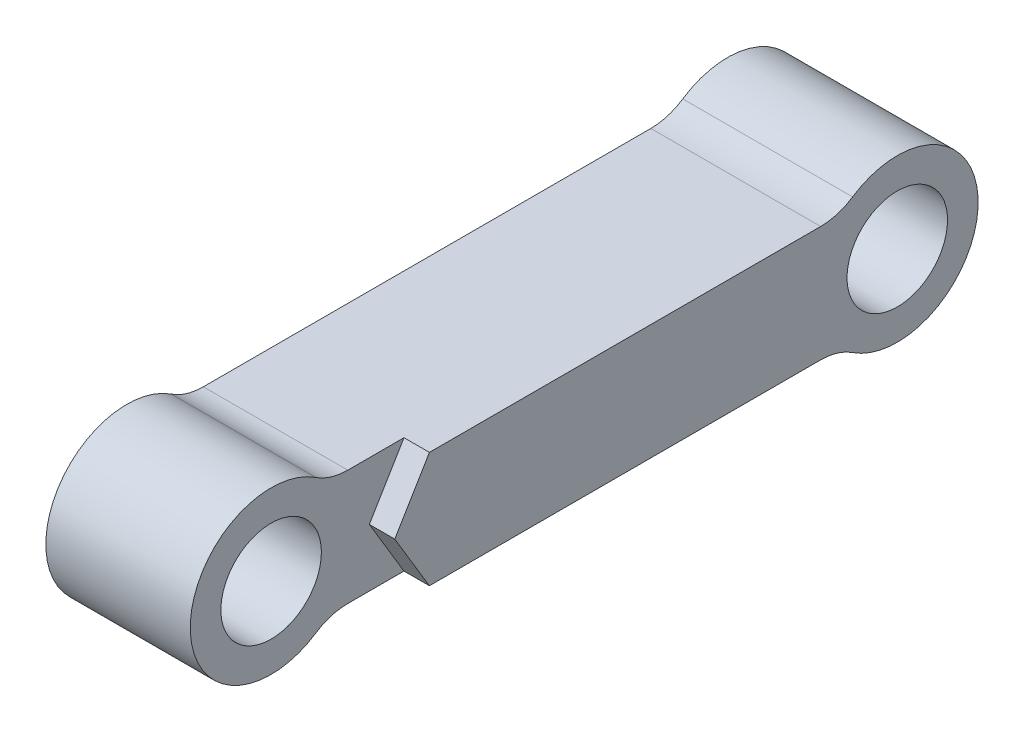
ISO-10303-21;
HEADER;
FILE_DESCRIPTION(('STEP AP214'),'2;1');
FILE_NAME('part.step','',(''),(''),'','','');
FILE_SCHEMA(('AUTOMOTIVE_DESIGN { 1 0 10303 214 1 1 1 1 }'));
ENDSEC;
DATA;
#1=APPLICATION_CONTEXT('core data for automotive mechanical design processes');
#2=APPLICATION_PROTOCOL_DEFINITION('international standard','automotive_design',2000,#1);
#3=PRODUCT_CONTEXT('',#1,'mechanical');
#4=PRODUCT('Part','Part','',(#3));
#5=PRODUCT_RELATED_PRODUCT_CATEGORY('part','',(#4));
#6=PRODUCT_DEFINITION_FORMATION('','',#4);
#7=PRODUCT_DEFINITION_CONTEXT('part definition',#1,'design');
#8=PRODUCT_DEFINITION('design','',#6,#7);
#9=PRODUCT_DEFINITION_SHAPE('','',#8);
#10=(LENGTH_UNIT() NAMED_UNIT(*) SI_UNIT(.MILLI.,.METRE.));
#11=(NAMED_UNIT(*) PLANE_ANGLE_UNIT() SI_UNIT($,.RADIAN.));
#12=(NAMED_UNIT(*) SI_UNIT($,.STERADIAN.) SOLID_ANGLE_UNIT());
#13=UNCERTAINTY_MEASURE_WITH_UNIT(LENGTH_MEASURE(1.E-05),#10,'distance_accuracy_value','');
#14=(GEOMETRIC_REPRESENTATION_CONTEXT(3) GLOBAL_UNCERTAINTY_ASSIGNED_CONTEXT((#13)) GLOBAL_UNIT_ASSIGNED_CONTEXT((#10,
#11,#12)) REPRESENTATION_CONTEXT('',''));
#15=CARTESIAN_POINT('',(0.,0.,0.));
#16=DIRECTION('',(0.,0.,1.));
#17=DIRECTION('',(1.,0.,0.));
#18=AXIS2_PLACEMENT_3D('',#15,#16,#17);
#19=CARTESIAN_POINT('',(14.7,5.,0.));
#20=DIRECTION('',(0.,1.,0.));
#21=DIRECTION('',(0.,0.,1.));
#22=AXIS2_PLACEMENT_3D('',#19,#20,#21);
#23=PLANE('',#22);
#24=DIRECTION('',(0.,0.,1.));
#25=VECTOR('',#24,1.);
#26=CARTESIAN_POINT('',(12.5,5.,0.));
#27=LINE('',#26,#25);
#28=CARTESIAN_POINT('',(12.5,5.,14.5));
#29=VERTEX_POINT('',#28);
#30=CARTESIAN_POINT('',(12.5,5.,19.3667504192892));
#31=VERTEX_POINT('',#30);
#32=EDGE_CURVE('E134',#29,#31,#27,.T.);
#33=ORIENTED_EDGE('',*,*,#32,.F.);
#34=DIRECTION('',(1.,0.,0.));
#35=VECTOR('',#34,1.);
#36=CARTESIAN_POINT('',(12.5,5.,14.5));
#37=LINE('',#36,#35);
#38=CARTESIAN_POINT('',(14.7,5.,14.5));
#39=VERTEX_POINT('',#38);
#40=EDGE_CURVE('E192',#29,#39,#37,.T.);
#41=ORIENTED_EDGE('',*,*,#40,.T.);
#42=DIRECTION('',(0.,0.,-1.));
#43=VECTOR('',#42,1.);
#44=CARTESIAN_POINT('',(14.7,5.,0.));
#45=LINE('',#44,#43);
#46=CARTESIAN_POINT('',(14.7,5.,-19.3667504192892));
#47=VERTEX_POINT('',#46);
#48=EDGE_CURVE('E98',#39,#47,#45,.T.);
#49=ORIENTED_EDGE('',*,*,#48,.T.);
#50=DIRECTION('',(-1.,0.,0.));
#51=VECTOR('',#50,1.);
#52=CARTESIAN_POINT('',(14.7,5.,-19.3667504192892));
#53=LINE('',#52,#51);
#54=CARTESIAN_POINT('',(0.,5.,-19.3667504192892));
#55=VERTEX_POINT('',#54);
#56=EDGE_CURVE('E11',#47,#55,#53,.T.);
#57=ORIENTED_EDGE('',*,*,#56,.T.);
#58=DIRECTION('',(0.,0.,-1.));
#59=VECTOR('',#58,1.);
#60=CARTESIAN_POINT('',(0.,5.,0.));
#61=LINE('',#60,#59);
#62=CARTESIAN_POINT('',(0.,5.,19.3667504192892));
#63=VERTEX_POINT('',#62);
#64=EDGE_CURVE('E183',#63,#55,#61,.T.);
#65=ORIENTED_EDGE('',*,*,#64,.F.);
#66=DIRECTION('',(-1.,0.,0.));
#67=VECTOR('',#66,1.);
#68=CARTESIAN_POINT('',(14.7,5.,19.3667504192892));
#69=LINE('',#68,#67);
#70=EDGE_CURVE('E43',#31,#63,#69,.T.);
#71=ORIENTED_EDGE('',*,*,#70,.F.);
#72=EDGE_LOOP('',(#33,#41,#49,#57,#65,#71));
#73=FACE_BOUND('',#72,.T.);
#74=ADVANCED_FACE('F35',(#73),#23,.T.);
#75=CARTESIAN_POINT('',(14.7,10.,19.3667504192892));
#76=DIRECTION('',(-1.,0.,0.));
#77=DIRECTION('',(0.,0.,1.));
#78=AXIS2_PLACEMENT_3D('',#75,#76,#77);
#79=CYLINDRICAL_SURFACE('',#78,5.);
#80=DIRECTION('',(-1.,0.,0.));
#81=VECTOR('',#80,1.);
#82=CARTESIAN_POINT('',(14.7,5.83333333333333,22.130604411252));
#83=LINE('',#82,#81);
#84=CARTESIAN_POINT('',(12.5,5.83333333333333,22.130604411252));
#85=VERTEX_POINT('',#84);
#86=CARTESIAN_POINT('',(0.,5.83333333333333,22.130604411252));
#87=VERTEX_POINT('',#86);
#88=EDGE_CURVE('E144',#85,#87,#83,.T.);
#89=ORIENTED_EDGE('',*,*,#88,.F.);
#90=CARTESIAN_POINT('',(12.5,10.,19.3667504192892));
#91=DIRECTION('',(1.,0.,0.));
#92=DIRECTION('',(0.,0.,-1.));
#93=AXIS2_PLACEMENT_3D('',#90,#91,#92);
#94=CIRCLE('',#93,5.);
#95=EDGE_CURVE('E127',#31,#85,#94,.F.);
#96=ORIENTED_EDGE('',*,*,#95,.F.);
#97=ORIENTED_EDGE('',*,*,#70,.T.);
#98=CARTESIAN_POINT('',(0.,10.,19.3667504192892));
#99=DIRECTION('',(1.,0.,0.));
#100=DIRECTION('',(0.,0.,-1.));
#101=AXIS2_PLACEMENT_3D('',#98,#99,#100);
#102=CIRCLE('',#101,5.);
#103=EDGE_CURVE('E152',#87,#63,#102,.T.);
#104=ORIENTED_EDGE('',*,*,#103,.F.);
#105=EDGE_LOOP('',(#89,#96,#97,#104));
#106=FACE_BOUND('',#105,.T.);
#107=ADVANCED_FACE('F150',(#106),#79,.F.);
#108=CARTESIAN_POINT('',(14.7,0.,26.));
#109=DIRECTION('',(-1.,0.,0.));
#110=DIRECTION('',(0.,0.,1.));
#111=AXIS2_PLACEMENT_3D('',#108,#109,#110);
#112=CYLINDRICAL_SURFACE('',#111,7.);
#113=CARTESIAN_POINT('',(12.5,0.,26.));
#114=DIRECTION('',(1.,0.,0.));
#115=DIRECTION('',(0.,0.,-1.));
#116=AXIS2_PLACEMENT_3D('',#113,#114,#115);
#117=CIRCLE('',#116,7.);
#118=CARTESIAN_POINT('',(12.5,-5.83333333333334,22.130604411252));
#119=VERTEX_POINT('',#118);
#120=EDGE_CURVE('E130',#85,#119,#117,.T.);
#121=ORIENTED_EDGE('',*,*,#120,.F.);
#122=ORIENTED_EDGE('',*,*,#88,.T.);
#123=CARTESIAN_POINT('',(0.,0.,26.));
#124=DIRECTION('',(1.,0.,0.));
#125=DIRECTION('',(0.,0.,-1.));
#126=AXIS2_PLACEMENT_3D('',#123,#124,#125);
#127=CIRCLE('',#126,7.);
#128=CARTESIAN_POINT('',(0.,-5.83333333333333,22.130604411252));
#129=VERTEX_POINT('',#128);
#130=EDGE_CURVE('E180',#87,#129,#127,.T.);
#131=ORIENTED_EDGE('',*,*,#130,.T.);
#132=DIRECTION('',(-1.,0.,0.));
#133=VECTOR('',#132,1.);
#134=CARTESIAN_POINT('',(14.7,-5.83333333333333,22.130604411252));
#135=LINE('',#134,#133);
#136=EDGE_CURVE('E146',#119,#129,#135,.T.);
#137=ORIENTED_EDGE('',*,*,#136,.F.);
#138=EDGE_LOOP('',(#121,#122,#131,#137));
#139=FACE_BOUND('',#138,.T.);
#140=ADVANCED_FACE('F142',(#139),#112,.T.);
#141=CARTESIAN_POINT('',(14.7,-10.,19.3667504192892));
#142=DIRECTION('',(-1.,0.,0.));
#143=DIRECTION('',(0.,0.,1.));
#144=AXIS2_PLACEMENT_3D('',#141,#142,#143);
#145=CYLINDRICAL_SURFACE('',#144,5.);
#146=CARTESIAN_POINT('',(12.5,-10.,19.3667504192892));
#147=DIRECTION('',(1.,0.,0.));
#148=DIRECTION('',(0.,0.,-1.));
#149=AXIS2_PLACEMENT_3D('',#146,#147,#148);
#150=CIRCLE('',#149,5.);
#151=CARTESIAN_POINT('',(12.5,-5.,19.3667504192892));
#152=VERTEX_POINT('',#151);
#153=EDGE_CURVE('E147',#119,#152,#150,.F.);
#154=ORIENTED_EDGE('',*,*,#153,.F.);
#155=ORIENTED_EDGE('',*,*,#136,.T.);
#156=CARTESIAN_POINT('',(0.,-10.,19.3667504192892));
#157=DIRECTION('',(1.,0.,0.));
#158=DIRECTION('',(0.,0.,-1.));
#159=AXIS2_PLACEMENT_3D('',#156,#157,#158);
#160=CIRCLE('',#159,5.);
#161=CARTESIAN_POINT('',(0.,-5.,19.3667504192892));
#162=VERTEX_POINT('',#161);
#163=EDGE_CURVE('E177',#129,#162,#160,.F.);
#164=ORIENTED_EDGE('',*,*,#163,.T.);
#165=DIRECTION('',(-1.,0.,0.));
#166=VECTOR('',#165,1.);
#167=CARTESIAN_POINT('',(14.7,-5.,19.3667504192892));
#168=LINE('',#167,#166);
#169=EDGE_CURVE('E154',#152,#162,#168,.T.);
#170=ORIENTED_EDGE('',*,*,#169,.F.);
#171=EDGE_LOOP('',(#154,#155,#164,#170));
#172=FACE_BOUND('',#171,.T.);
#173=ADVANCED_FACE('F240',(#172),#145,.F.);
#174=CARTESIAN_POINT('',(14.7,-5.,0.));
#175=DIRECTION('',(0.,1.,0.));
#176=DIRECTION('',(0.,0.,1.));
#177=AXIS2_PLACEMENT_3D('',#174,#175,#176);
#178=PLANE('',#177);
#179=DIRECTION('',(1.,0.,0.));
#180=VECTOR('',#179,1.);
#181=CARTESIAN_POINT('',(12.5,-5.,14.5));
#182=LINE('',#181,#180);
#183=CARTESIAN_POINT('',(12.5,-5.,14.5));
#184=VERTEX_POINT('',#183);
#185=CARTESIAN_POINT('',(14.7,-5.,14.5));
#186=VERTEX_POINT('',#185);
#187=EDGE_CURVE('E50',#184,#186,#182,.T.);
#188=ORIENTED_EDGE('',*,*,#187,.F.);
#189=DIRECTION('',(0.,0.,-1.));
#190=VECTOR('',#189,1.);
#191=CARTESIAN_POINT('',(12.5,-5.,0.));
#192=LINE('',#191,#190);
#193=EDGE_CURVE('E219',#152,#184,#192,.T.);
#194=ORIENTED_EDGE('',*,*,#193,.F.);
#195=ORIENTED_EDGE('',*,*,#169,.T.);
#196=DIRECTION('',(0.,0.,-1.));
#197=VECTOR('',#196,1.);
#198=CARTESIAN_POINT('',(0.,-5.,0.));
#199=LINE('',#198,#197);
#200=CARTESIAN_POINT('',(0.,-5.,-19.3667504192892));
#201=VERTEX_POINT('',#200);
#202=EDGE_CURVE('E174',#162,#201,#199,.T.);
#203=ORIENTED_EDGE('',*,*,#202,.T.);
#204=DIRECTION('',(-1.,0.,0.));
#205=VECTOR('',#204,1.);
#206=CARTESIAN_POINT('',(14.7,-5.,-19.3667504192892));
#207=LINE('',#206,#205);
#208=CARTESIAN_POINT('',(14.7,-5.,-19.3667504192892));
#209=VERTEX_POINT('',#208);
#210=EDGE_CURVE('E158',#209,#201,#207,.T.);
#211=ORIENTED_EDGE('',*,*,#210,.F.);
#212=DIRECTION('',(0.,0.,-1.));
#213=VECTOR('',#212,1.);
#214=CARTESIAN_POINT('',(14.7,-5.,0.));
#215=LINE('',#214,#213);
#216=EDGE_CURVE('E196',#186,#209,#215,.T.);
#217=ORIENTED_EDGE('',*,*,#216,.F.);
#218=EDGE_LOOP('',(#188,#194,#195,#203,#211,#217));
#219=FACE_BOUND('',#218,.T.);
#220=ADVANCED_FACE('F230',(#219),#178,.F.);
#221=CARTESIAN_POINT('',(14.7,0.,26.));
#222=DIRECTION('',(-1.,0.,0.));
#223=DIRECTION('',(0.,0.,1.));
#224=AXIS2_PLACEMENT_3D('',#221,#222,#223);
#225=CYLINDRICAL_SURFACE('',#224,4.35);
#226=CARTESIAN_POINT('',(0.,0.,26.));
#227=DIRECTION('',(1.,0.,0.));
#228=DIRECTION('',(0.,0.,-1.));
#229=AXIS2_PLACEMENT_3D('',#226,#227,#228);
#230=CIRCLE('',#229,4.35);
#231=CARTESIAN_POINT('',(0.,0.,21.65));
#232=VERTEX_POINT('',#231);
#233=EDGE_CURVE('E165',#232,#232,#230,.T.);
#234=ORIENTED_EDGE('',*,*,#233,.F.);
#235=EDGE_LOOP('',(#234));
#236=FACE_BOUND('',#235,.T.);
#237=CARTESIAN_POINT('',(12.5,0.,26.));
#238=DIRECTION('',(1.,0.,0.));
#239=DIRECTION('',(0.,0.,-1.));
#240=AXIS2_PLACEMENT_3D('',#237,#238,#239);
#241=CIRCLE('',#240,4.35);
#242=CARTESIAN_POINT('',(12.5,0.,21.65));
#243=VERTEX_POINT('',#242);
#244=EDGE_CURVE('E138',#243,#243,#241,.F.);
#245=ORIENTED_EDGE('',*,*,#244,.F.);
#246=EDGE_LOOP('',(#245));
#247=FACE_BOUND('',#246,.T.);
#248=ADVANCED_FACE('F227',(#236,#247),#225,.F.);
#249=CARTESIAN_POINT('',(14.7,0.,0.));
#250=DIRECTION('',(1.,0.,0.));
#251=DIRECTION('',(0.,0.,-1.));
#252=AXIS2_PLACEMENT_3D('',#249,#250,#251);
#253=PLANE('',#252);
#254=CARTESIAN_POINT('',(14.7,0.,-26.));
#255=DIRECTION('',(1.,0.,0.));
#256=DIRECTION('',(0.,0.,-1.));
#257=AXIS2_PLACEMENT_3D('',#254,#255,#256);
#258=CIRCLE('',#257,4.35);
#259=CARTESIAN_POINT('',(14.7,0.,-30.35));
#260=VERTEX_POINT('',#259);
#261=EDGE_CURVE('E168',#260,#260,#258,.T.);
#262=ORIENTED_EDGE('',*,*,#261,.F.);
#263=EDGE_LOOP('',(#262));
#264=FACE_BOUND('',#263,.T.);
#265=ORIENTED_EDGE('',*,*,#48,.F.);
#266=DIRECTION('',(0.,-0.857492925712544,0.514495755427526));
#267=VECTOR('',#266,1.);
#268=CARTESIAN_POINT('',(14.7,7.72058823529412,12.8676470588235));
#269=LINE('',#268,#267);
#270=CARTESIAN_POINT('',(14.7,0.,17.5));
#271=VERTEX_POINT('',#270);
#272=EDGE_CURVE('E208',#39,#271,#269,.T.);
#273=ORIENTED_EDGE('',*,*,#272,.T.);
#274=DIRECTION('',(0.,-0.857492925712544,-0.514495755427526));
#275=VECTOR('',#274,1.);
#276=CARTESIAN_POINT('',(14.7,-7.72058823529412,12.8676470588235));
#277=LINE('',#276,#275);
#278=EDGE_CURVE('E211',#271,#186,#277,.T.);
#279=ORIENTED_EDGE('',*,*,#278,.T.);
#280=ORIENTED_EDGE('',*,*,#216,.T.);
#281=CARTESIAN_POINT('',(14.7,-10.,-19.3667504192892));
#282=DIRECTION('',(1.,0.,0.));
#283=DIRECTION('',(0.,0.,-1.));
#284=AXIS2_PLACEMENT_3D('',#281,#282,#283);
#285=CIRCLE('',#284,5.);
#286=CARTESIAN_POINT('',(14.7,-5.83333333333333,-22.130604411252));
#287=VERTEX_POINT('',#286);
#288=EDGE_CURVE('E194',#209,#287,#285,.F.);
#289=ORIENTED_EDGE('',*,*,#288,.T.);
#290=CARTESIAN_POINT('',(14.7,0.,-26.));
#291=DIRECTION('',(1.,0.,0.));
#292=DIRECTION('',(0.,0.,-1.));
#293=AXIS2_PLACEMENT_3D('',#290,#291,#292);
#294=CIRCLE('',#293,7.);
#295=CARTESIAN_POINT('',(14.7,5.83333333333334,-22.130604411252));
#296=VERTEX_POINT('',#295);
#297=EDGE_CURVE('E59',#287,#296,#294,.T.);
#298=ORIENTED_EDGE('',*,*,#297,.T.);
#299=CARTESIAN_POINT('',(14.7,10.,-19.3667504192892));
#300=DIRECTION('',(1.,0.,0.));
#301=DIRECTION('',(0.,0.,-1.));
#302=AXIS2_PLACEMENT_3D('',#299,#300,#301);
#303=CIRCLE('',#302,5.);
#304=EDGE_CURVE('E199',#47,#296,#303,.T.);
#305=ORIENTED_EDGE('',*,*,#304,.F.);
#306=EDGE_LOOP('',(#265,#273,#279,#280,#289,#298,#305));
#307=FACE_BOUND('',#306,.T.);
#308=ADVANCED_FACE('F229',(#264,#307),#253,.T.);
#309=CARTESIAN_POINT('',(14.7,10.,-19.3667504192892));
#310=DIRECTION('',(-1.,0.,0.));
#311=DIRECTION('',(0.,0.,1.));
#312=AXIS2_PLACEMENT_3D('',#309,#310,#311);
#313=CYLINDRICAL_SURFACE('',#312,5.);
#314=CARTESIAN_POINT('',(0.,10.,-19.3667504192892));
#315=DIRECTION('',(1.,0.,0.));
#316=DIRECTION('',(0.,0.,-1.));
#317=AXIS2_PLACEMENT_3D('',#314,#315,#316);
#318=CIRCLE('',#317,5.);
#319=CARTESIAN_POINT('',(0.,5.83333333333334,-22.130604411252));
#320=VERTEX_POINT('',#319);
#321=EDGE_CURVE('E186',#55,#320,#318,.T.);
#322=ORIENTED_EDGE('',*,*,#321,.F.);
#323=ORIENTED_EDGE('',*,*,#56,.F.);
#324=ORIENTED_EDGE('',*,*,#304,.T.);
#325=DIRECTION('',(-1.,0.,0.));
#326=VECTOR('',#325,1.);
#327=CARTESIAN_POINT('',(14.7,5.83333333333334,-22.130604411252));
#328=LINE('',#327,#326);
#329=EDGE_CURVE('E91',#296,#320,#328,.T.);
#330=ORIENTED_EDGE('',*,*,#329,.T.);
#331=EDGE_LOOP('',(#322,#323,#324,#330));
#332=FACE_BOUND('',#331,.T.);
#333=ADVANCED_FACE('F237',(#332),#313,.F.);
#334=CARTESIAN_POINT('',(14.7,-10.,-19.3667504192892));
#335=DIRECTION('',(-1.,0.,0.));
#336=DIRECTION('',(0.,0.,1.));
#337=AXIS2_PLACEMENT_3D('',#334,#335,#336);
#338=CYLINDRICAL_SURFACE('',#337,5.);
#339=CARTESIAN_POINT('',(0.,-10.,-19.3667504192892));
#340=DIRECTION('',(1.,0.,0.));
#341=DIRECTION('',(0.,0.,-1.));
#342=AXIS2_PLACEMENT_3D('',#339,#340,#341);
#343=CIRCLE('',#342,5.);
#344=CARTESIAN_POINT('',(0.,-5.83333333333333,-22.130604411252));
#345=VERTEX_POINT('',#344);
#346=EDGE_CURVE('E171',#201,#345,#343,.F.);
#347=ORIENTED_EDGE('',*,*,#346,.T.);
#348=DIRECTION('',(-1.,0.,0.));
#349=VECTOR('',#348,1.);
#350=CARTESIAN_POINT('',(14.7,-5.83333333333333,-22.130604411252));
#351=LINE('',#350,#349);
#352=EDGE_CURVE('E161',#287,#345,#351,.T.);
#353=ORIENTED_EDGE('',*,*,#352,.F.);
#354=ORIENTED_EDGE('',*,*,#288,.F.);
#355=ORIENTED_EDGE('',*,*,#210,.T.);
#356=EDGE_LOOP('',(#347,#353,#354,#355));
#357=FACE_BOUND('',#356,.T.);
#358=ADVANCED_FACE('F254',(#357),#338,.F.);
#359=CARTESIAN_POINT('',(14.7,0.,-26.));
#360=DIRECTION('',(-1.,0.,0.));
#361=DIRECTION('',(0.,0.,1.));
#362=AXIS2_PLACEMENT_3D('',#359,#360,#361);
#363=CYLINDRICAL_SURFACE('',#362,7.);
#364=CARTESIAN_POINT('',(0.,0.,-26.));
#365=DIRECTION('',(1.,0.,0.));
#366=DIRECTION('',(0.,0.,-1.));
#367=AXIS2_PLACEMENT_3D('',#364,#365,#366);
#368=CIRCLE('',#367,7.);
#369=EDGE_CURVE('E169',#345,#320,#368,.T.);
#370=ORIENTED_EDGE('',*,*,#369,.T.);
#371=ORIENTED_EDGE('',*,*,#329,.F.);
#372=ORIENTED_EDGE('',*,*,#297,.F.);
#373=ORIENTED_EDGE('',*,*,#352,.T.);
#374=EDGE_LOOP('',(#370,#371,#372,#373));
#375=FACE_BOUND('',#374,.T.);
#376=ADVANCED_FACE('F258',(#375),#363,.T.);
#377=CARTESIAN_POINT('',(14.7,0.,-26.));
#378=DIRECTION('',(-1.,0.,0.));
#379=DIRECTION('',(0.,0.,1.));
#380=AXIS2_PLACEMENT_3D('',#377,#378,#379);
#381=CYLINDRICAL_SURFACE('',#380,4.35);
#382=ORIENTED_EDGE('',*,*,#261,.T.);
#383=EDGE_LOOP('',(#382));
#384=FACE_BOUND('',#383,.T.);
#385=CARTESIAN_POINT('',(0.,0.,-26.));
#386=DIRECTION('',(1.,0.,0.));
#387=DIRECTION('',(0.,0.,-1.));
#388=AXIS2_PLACEMENT_3D('',#385,#386,#387);
#389=CIRCLE('',#388,4.35);
#390=CARTESIAN_POINT('',(0.,0.,-30.35));
#391=VERTEX_POINT('',#390);
#392=EDGE_CURVE('E189',#391,#391,#389,.T.);
#393=ORIENTED_EDGE('',*,*,#392,.F.);
#394=EDGE_LOOP('',(#393));
#395=FACE_BOUND('',#394,.T.);
#396=ADVANCED_FACE('F37',(#384,#395),#381,.F.);
#397=CARTESIAN_POINT('',(0.,0.,0.));
#398=DIRECTION('',(1.,0.,0.));
#399=DIRECTION('',(0.,0.,-1.));
#400=AXIS2_PLACEMENT_3D('',#397,#398,#399);
#401=PLANE('',#400);
#402=ORIENTED_EDGE('',*,*,#392,.T.);
#403=EDGE_LOOP('',(#402));
#404=FACE_BOUND('',#403,.T.);
#405=ORIENTED_EDGE('',*,*,#321,.T.);
#406=ORIENTED_EDGE('',*,*,#369,.F.);
#407=ORIENTED_EDGE('',*,*,#346,.F.);
#408=ORIENTED_EDGE('',*,*,#202,.F.);
#409=ORIENTED_EDGE('',*,*,#163,.F.);
#410=ORIENTED_EDGE('',*,*,#130,.F.);
#411=ORIENTED_EDGE('',*,*,#103,.T.);
#412=ORIENTED_EDGE('',*,*,#64,.T.);
#413=EDGE_LOOP('',(#405,#406,#407,#408,#409,#410,#411,#412));
#414=FACE_BOUND('',#413,.T.);
#415=ORIENTED_EDGE('',*,*,#233,.T.);
#416=EDGE_LOOP('',(#415));
#417=FACE_BOUND('',#416,.T.);
#418=ADVANCED_FACE('F263',(#404,#414,#417),#401,.F.);
#419=CARTESIAN_POINT('',(12.5,7.72058823529412,12.8676470588235));
#420=DIRECTION('',(0.,0.514495755427526,0.857492925712544));
#421=DIRECTION('',(0.,-0.857492925712544,0.514495755427526));
#422=AXIS2_PLACEMENT_3D('',#419,#420,#421);
#423=PLANE('',#422);
#424=ORIENTED_EDGE('',*,*,#272,.F.);
#425=ORIENTED_EDGE('',*,*,#40,.F.);
#426=DIRECTION('',(0.,-0.857492925712544,0.514495755427526));
#427=VECTOR('',#426,1.);
#428=CARTESIAN_POINT('',(12.5,7.72058823529412,12.8676470588235));
#429=LINE('',#428,#427);
#430=CARTESIAN_POINT('',(12.5,0.,17.5));
#431=VERTEX_POINT('',#430);
#432=EDGE_CURVE('E214',#29,#431,#429,.T.);
#433=ORIENTED_EDGE('',*,*,#432,.T.);
#434=DIRECTION('',(1.,0.,0.));
#435=VECTOR('',#434,1.);
#436=CARTESIAN_POINT('',(12.5,0.,17.5));
#437=LINE('',#436,#435);
#438=EDGE_CURVE('E204',#431,#271,#437,.T.);
#439=ORIENTED_EDGE('',*,*,#438,.T.);
#440=EDGE_LOOP('',(#424,#425,#433,#439));
#441=FACE_BOUND('',#440,.T.);
#442=ADVANCED_FACE('F267',(#441),#423,.T.);
#443=CARTESIAN_POINT('',(12.5,-7.72058823529412,12.8676470588235));
#444=DIRECTION('',(0.,-0.514495755427526,0.857492925712544));
#445=DIRECTION('',(0.,-0.857492925712544,-0.514495755427526));
#446=AXIS2_PLACEMENT_3D('',#443,#444,#445);
#447=PLANE('',#446);
#448=ORIENTED_EDGE('',*,*,#278,.F.);
#449=ORIENTED_EDGE('',*,*,#438,.F.);
#450=DIRECTION('',(0.,-0.857492925712544,-0.514495755427526));
#451=VECTOR('',#450,1.);
#452=CARTESIAN_POINT('',(12.5,-7.72058823529412,12.8676470588235));
#453=LINE('',#452,#451);
#454=EDGE_CURVE('E217',#431,#184,#453,.T.);
#455=ORIENTED_EDGE('',*,*,#454,.T.);
#456=ORIENTED_EDGE('',*,*,#187,.T.);
#457=EDGE_LOOP('',(#448,#449,#455,#456));
#458=FACE_BOUND('',#457,.T.);
#459=ADVANCED_FACE('F269',(#458),#447,.T.);
#460=CARTESIAN_POINT('',(12.5,0.,0.));
#461=DIRECTION('',(1.,0.,0.));
#462=DIRECTION('',(0.,0.,-1.));
#463=AXIS2_PLACEMENT_3D('',#460,#461,#462);
#464=PLANE('',#463);
#465=ORIENTED_EDGE('',*,*,#244,.T.);
#466=EDGE_LOOP('',(#465));
#467=FACE_BOUND('',#466,.T.);
#468=ORIENTED_EDGE('',*,*,#95,.T.);
#469=ORIENTED_EDGE('',*,*,#120,.T.);
#470=ORIENTED_EDGE('',*,*,#153,.T.);
#471=ORIENTED_EDGE('',*,*,#193,.T.);
#472=ORIENTED_EDGE('',*,*,#454,.F.);
#473=ORIENTED_EDGE('',*,*,#432,.F.);
#474=ORIENTED_EDGE('',*,*,#32,.T.);
#475=EDGE_LOOP('',(#468,#469,#470,#471,#472,#473,#474));
#476=FACE_BOUND('',#475,.T.);
#477=ADVANCED_FACE('F129',(#467,#476),#464,.T.);
#478=CLOSED_SHELL('',(#74,#107,#140,#173,#220,#248,#308,#333,#358,#376,#396,#418,#442,#459,#477));
#479=MANIFOLD_SOLID_BREP('B2',#478);
#480=ADVANCED_BREP_SHAPE_REPRESENTATION('',(#18,#479),#14);
#481=SHAPE_DEFINITION_REPRESENTATION(#9,#480);
ENDSEC;
END-ISO-10303-21;
